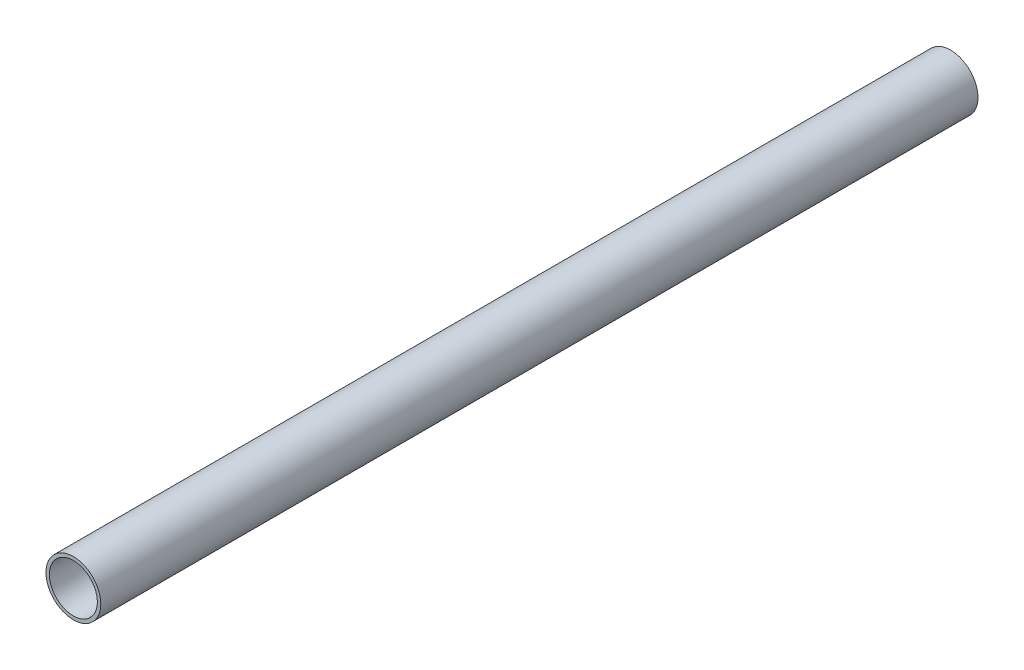
ISO-10303-21;
HEADER;
FILE_DESCRIPTION(('STEP AP214'),'2;1');
FILE_NAME('part.step','',(''),(''),'','','');
FILE_SCHEMA(('AUTOMOTIVE_DESIGN { 1 0 10303 214 1 1 1 1 }'));
ENDSEC;
DATA;
#1=APPLICATION_CONTEXT('core data for automotive mechanical design processes');
#2=APPLICATION_PROTOCOL_DEFINITION('international standard','automotive_design',2000,#1);
#3=PRODUCT_CONTEXT('',#1,'mechanical');
#4=PRODUCT('Part','Part','',(#3));
#5=PRODUCT_RELATED_PRODUCT_CATEGORY('part','',(#4));
#6=PRODUCT_DEFINITION_FORMATION('','',#4);
#7=PRODUCT_DEFINITION_CONTEXT('part definition',#1,'design');
#8=PRODUCT_DEFINITION('design','',#6,#7);
#9=PRODUCT_DEFINITION_SHAPE('','',#8);
#10=(LENGTH_UNIT() NAMED_UNIT(*) SI_UNIT(.MILLI.,.METRE.));
#11=(NAMED_UNIT(*) PLANE_ANGLE_UNIT() SI_UNIT($,.RADIAN.));
#12=(NAMED_UNIT(*) SI_UNIT($,.STERADIAN.) SOLID_ANGLE_UNIT());
#13=UNCERTAINTY_MEASURE_WITH_UNIT(LENGTH_MEASURE(1.E-05),#10,'distance_accuracy_value','');
#14=(GEOMETRIC_REPRESENTATION_CONTEXT(3) GLOBAL_UNCERTAINTY_ASSIGNED_CONTEXT((#13)) GLOBAL_UNIT_ASSIGNED_CONTEXT((#10,
#11,#12)) REPRESENTATION_CONTEXT('',''));
#15=CARTESIAN_POINT('',(0.,0.,0.));
#16=DIRECTION('',(0.,0.,1.));
#17=DIRECTION('',(1.,0.,0.));
#18=AXIS2_PLACEMENT_3D('',#15,#16,#17);
#19=CARTESIAN_POINT('',(0.,0.,406.4));
#20=DIRECTION('',(0.,0.,1.));
#21=DIRECTION('',(1.,0.,0.));
#22=AXIS2_PLACEMENT_3D('',#19,#20,#21);
#23=PLANE('',#22);
#24=CARTESIAN_POINT('',(0.,0.,406.4));
#25=DIRECTION('',(0.,0.,1.));
#26=DIRECTION('',(1.,0.,0.));
#27=AXIS2_PLACEMENT_3D('',#24,#25,#26);
#28=CIRCLE('',#27,12.7);
#29=CARTESIAN_POINT('',(12.7,0.,406.4));
#30=VERTEX_POINT('',#29);
#31=EDGE_CURVE('E10',#30,#30,#28,.T.);
#32=ORIENTED_EDGE('',*,*,#31,.T.);
#33=EDGE_LOOP('',(#32));
#34=FACE_BOUND('',#33,.T.);
#35=CARTESIAN_POINT('',(0.,0.,406.4));
#36=DIRECTION('',(0.,0.,1.));
#37=DIRECTION('',(1.,0.,0.));
#38=AXIS2_PLACEMENT_3D('',#35,#36,#37);
#39=CIRCLE('',#38,11.1125);
#40=CARTESIAN_POINT('',(11.1125,0.,406.4));
#41=VERTEX_POINT('',#40);
#42=EDGE_CURVE('E51',#41,#41,#39,.T.);
#43=ORIENTED_EDGE('',*,*,#42,.F.);
#44=EDGE_LOOP('',(#43));
#45=FACE_BOUND('',#44,.T.);
#46=ADVANCED_FACE('F36',(#34,#45),#23,.T.);
#47=CARTESIAN_POINT('',(0.,0.,0.));
#48=DIRECTION('',(0.,0.,1.));
#49=DIRECTION('',(1.,0.,0.));
#50=AXIS2_PLACEMENT_3D('',#47,#48,#49);
#51=PLANE('',#50);
#52=CARTESIAN_POINT('',(0.,0.,0.));
#53=DIRECTION('',(0.,0.,1.));
#54=DIRECTION('',(1.,0.,0.));
#55=AXIS2_PLACEMENT_3D('',#52,#53,#54);
#56=CIRCLE('',#55,12.7);
#57=CARTESIAN_POINT('',(12.7,0.,0.));
#58=VERTEX_POINT('',#57);
#59=EDGE_CURVE('E40',#58,#58,#56,.T.);
#60=ORIENTED_EDGE('',*,*,#59,.F.);
#61=EDGE_LOOP('',(#60));
#62=FACE_BOUND('',#61,.T.);
#63=CARTESIAN_POINT('',(0.,0.,0.));
#64=DIRECTION('',(0.,0.,1.));
#65=DIRECTION('',(1.,0.,0.));
#66=AXIS2_PLACEMENT_3D('',#63,#64,#65);
#67=CIRCLE('',#66,11.1125);
#68=CARTESIAN_POINT('',(11.1125,0.,0.));
#69=VERTEX_POINT('',#68);
#70=EDGE_CURVE('E53',#69,#69,#67,.T.);
#71=ORIENTED_EDGE('',*,*,#70,.T.);
#72=EDGE_LOOP('',(#71));
#73=FACE_BOUND('',#72,.T.);
#74=ADVANCED_FACE('F63',(#62,#73),#51,.F.);
#75=CARTESIAN_POINT('',(0.,0.,406.4));
#76=DIRECTION('',(0.,0.,-1.));
#77=DIRECTION('',(-1.,0.,0.));
#78=AXIS2_PLACEMENT_3D('',#75,#76,#77);
#79=CYLINDRICAL_SURFACE('',#78,12.7);
#80=ORIENTED_EDGE('',*,*,#31,.F.);
#81=EDGE_LOOP('',(#80));
#82=FACE_BOUND('',#81,.T.);
#83=ORIENTED_EDGE('',*,*,#59,.T.);
#84=EDGE_LOOP('',(#83));
#85=FACE_BOUND('',#84,.T.);
#86=ADVANCED_FACE('F38',(#82,#85),#79,.T.);
#87=CARTESIAN_POINT('',(0.,0.,406.4));
#88=DIRECTION('',(0.,0.,-1.));
#89=DIRECTION('',(-1.,0.,0.));
#90=AXIS2_PLACEMENT_3D('',#87,#88,#89);
#91=CYLINDRICAL_SURFACE('',#90,11.1125);
#92=ORIENTED_EDGE('',*,*,#42,.T.);
#93=EDGE_LOOP('',(#92));
#94=FACE_BOUND('',#93,.T.);
#95=ORIENTED_EDGE('',*,*,#70,.F.);
#96=EDGE_LOOP('',(#95));
#97=FACE_BOUND('',#96,.T.);
#98=ADVANCED_FACE('F59',(#94,#97),#91,.F.);
#99=CLOSED_SHELL('',(#46,#74,#86,#98));
#100=MANIFOLD_SOLID_BREP('B2',#99);
#101=ADVANCED_BREP_SHAPE_REPRESENTATION('',(#18,#100),#14);
#102=SHAPE_DEFINITION_REPRESENTATION(#9,#101);
ENDSEC;
END-ISO-10303-21;
